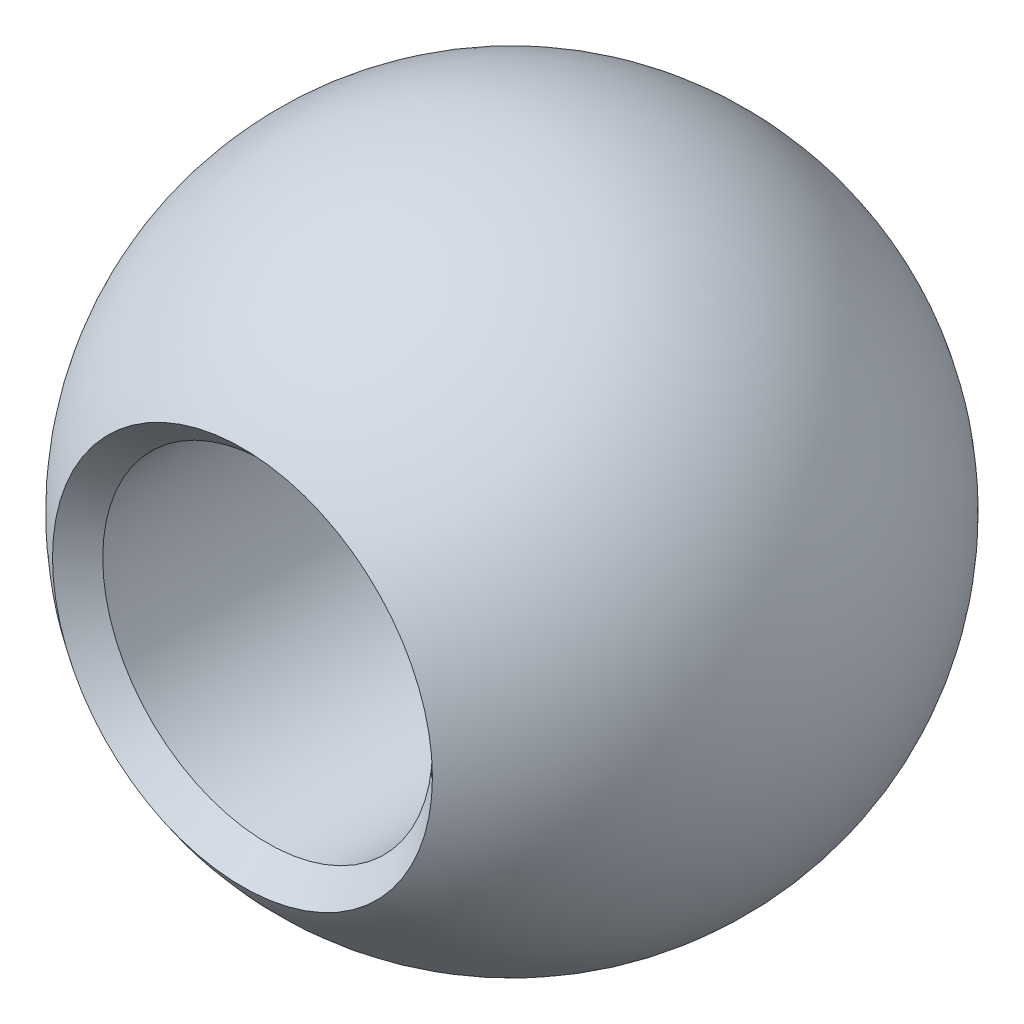
ISO-10303-21;
HEADER;
FILE_DESCRIPTION(('STEP AP214'),'2;1');
FILE_NAME('part.step','',(''),(''),'','','');
FILE_SCHEMA(('AUTOMOTIVE_DESIGN { 1 0 10303 214 1 1 1 1 }'));
ENDSEC;
DATA;
#1=APPLICATION_CONTEXT('core data for automotive mechanical design processes');
#2=APPLICATION_PROTOCOL_DEFINITION('international standard','automotive_design',2000,#1);
#3=PRODUCT_CONTEXT('',#1,'mechanical');
#4=PRODUCT('Part','Part','',(#3));
#5=PRODUCT_RELATED_PRODUCT_CATEGORY('part','',(#4));
#6=PRODUCT_DEFINITION_FORMATION('','',#4);
#7=PRODUCT_DEFINITION_CONTEXT('part definition',#1,'design');
#8=PRODUCT_DEFINITION('design','',#6,#7);
#9=PRODUCT_DEFINITION_SHAPE('','',#8);
#10=(LENGTH_UNIT() NAMED_UNIT(*) SI_UNIT(.MILLI.,.METRE.));
#11=(NAMED_UNIT(*) PLANE_ANGLE_UNIT() SI_UNIT($,.RADIAN.));
#12=(NAMED_UNIT(*) SI_UNIT($,.STERADIAN.) SOLID_ANGLE_UNIT());
#13=UNCERTAINTY_MEASURE_WITH_UNIT(LENGTH_MEASURE(1.E-05),#10,'distance_accuracy_value','');
#14=(GEOMETRIC_REPRESENTATION_CONTEXT(3) GLOBAL_UNCERTAINTY_ASSIGNED_CONTEXT((#13)) GLOBAL_UNIT_ASSIGNED_CONTEXT((#10,
#11,#12)) REPRESENTATION_CONTEXT('',''));
#15=CARTESIAN_POINT('',(0.,0.,0.));
#16=DIRECTION('',(0.,0.,1.));
#17=DIRECTION('',(1.,0.,0.));
#18=AXIS2_PLACEMENT_3D('',#15,#16,#17);
#19=CARTESIAN_POINT('',(0.,0.,0.));
#20=DIRECTION('',(0.,1.,0.));
#21=DIRECTION('',(1.,0.,0.));
#22=AXIS2_PLACEMENT_3D('',#19,#20,#21);
#23=SPHERICAL_SURFACE('',#22,8.);
#24=CARTESIAN_POINT('',(0.,0.,0.));
#25=DIRECTION('',(0.,0.,1.));
#26=DIRECTION('',(1.,0.,0.));
#27=AXIS2_PLACEMENT_3D('',#24,#25,#26);
#28=SPHERICAL_SURFACE('',#27,8.);
#29=CARTESIAN_POINT('',(0.,0.,-6.53819419381716));
#30=DIRECTION('',(0.,0.,1.));
#31=DIRECTION('',(1.,0.,0.));
#32=AXIS2_PLACEMENT_3D('',#29,#30,#31);
#33=CIRCLE('',#32,4.60999096354164);
#34=CARTESIAN_POINT('',(4.60999096354164,0.,-6.53819419381716));
#35=VERTEX_POINT('',#34);
#36=EDGE_CURVE('E45',#35,#35,#33,.T.);
#37=ORIENTED_EDGE('',*,*,#36,.T.);
#38=EDGE_LOOP('',(#37));
#39=FACE_BOUND('',#38,.T.);
#40=CARTESIAN_POINT('',(0.,0.,6.53819419381716));
#41=DIRECTION('',(0.,0.,-1.));
#42=DIRECTION('',(-1.,0.,0.));
#43=AXIS2_PLACEMENT_3D('',#40,#41,#42);
#44=CIRCLE('',#43,4.60999096354165);
#45=CARTESIAN_POINT('',(-4.60999096354165,0.,6.53819419381716));
#46=VERTEX_POINT('',#45);
#47=EDGE_CURVE('E49',#46,#46,#44,.T.);
#48=ORIENTED_EDGE('',*,*,#47,.T.);
#49=EDGE_LOOP('',(#48));
#50=FACE_BOUND('',#49,.T.);
#51=ADVANCED_FACE('F34',(#39,#50),#28,.T.);
#52=CARTESIAN_POINT('',(0.,0.,-8.));
#53=DIRECTION('',(0.,0.,1.));
#54=DIRECTION('',(1.,0.,0.));
#55=AXIS2_PLACEMENT_3D('',#52,#53,#54);
#56=CYLINDRICAL_SURFACE('',#55,4.);
#57=CARTESIAN_POINT('',(0.,0.,-5.92820323027552));
#58=DIRECTION('',(0.,0.,1.));
#59=DIRECTION('',(1.,0.,0.));
#60=AXIS2_PLACEMENT_3D('',#57,#58,#59);
#61=CIRCLE('',#60,4.);
#62=CARTESIAN_POINT('',(4.,0.,-5.92820323027552));
#63=VERTEX_POINT('',#62);
#64=EDGE_CURVE('E10',#63,#63,#61,.F.);
#65=ORIENTED_EDGE('',*,*,#64,.T.);
#66=EDGE_LOOP('',(#65));
#67=FACE_BOUND('',#66,.T.);
#68=CARTESIAN_POINT('',(0.,0.,5.92820323027551));
#69=DIRECTION('',(0.,0.,-1.));
#70=DIRECTION('',(-1.,0.,0.));
#71=AXIS2_PLACEMENT_3D('',#68,#69,#70);
#72=CIRCLE('',#71,4.);
#73=CARTESIAN_POINT('',(-4.,0.,5.92820323027551));
#74=VERTEX_POINT('',#73);
#75=EDGE_CURVE('E41',#74,#74,#72,.F.);
#76=ORIENTED_EDGE('',*,*,#75,.T.);
#77=EDGE_LOOP('',(#76));
#78=FACE_BOUND('',#77,.T.);
#79=ADVANCED_FACE('F62',(#67,#78),#56,.F.);
#80=CARTESIAN_POINT('',(0.,0.,-6.53819419381716));
#81=DIRECTION('',(0.,0.,-1.));
#82=DIRECTION('',(-1.,0.,0.));
#83=AXIS2_PLACEMENT_3D('',#80,#81,#82);
#84=CONICAL_SURFACE('',#83,4.60999096354164,0.785398163397443);
#85=ORIENTED_EDGE('',*,*,#64,.F.);
#86=EDGE_LOOP('',(#85));
#87=FACE_BOUND('',#86,.T.);
#88=ORIENTED_EDGE('',*,*,#36,.F.);
#89=EDGE_LOOP('',(#88));
#90=FACE_BOUND('',#89,.T.);
#91=ADVANCED_FACE('F57',(#87,#90),#84,.F.);
#92=CARTESIAN_POINT('',(0.,0.,6.53819419381715));
#93=DIRECTION('',(0.,0.,1.));
#94=DIRECTION('',(1.,0.,0.));
#95=AXIS2_PLACEMENT_3D('',#92,#93,#94);
#96=CONICAL_SURFACE('',#95,4.60999096354165,0.785398163397448);
#97=ORIENTED_EDGE('',*,*,#75,.F.);
#98=EDGE_LOOP('',(#97));
#99=FACE_BOUND('',#98,.T.);
#100=ORIENTED_EDGE('',*,*,#47,.F.);
#101=EDGE_LOOP('',(#100));
#102=FACE_BOUND('',#101,.T.);
#103=ADVANCED_FACE('F36',(#99,#102),#96,.F.);
#104=CLOSED_SHELL('',(#51,#79,#91,#103));
#105=MANIFOLD_SOLID_BREP('B2',#104);
#106=ADVANCED_BREP_SHAPE_REPRESENTATION('',(#18,#105),#14);
#107=SHAPE_DEFINITION_REPRESENTATION(#9,#106);
ENDSEC;
END-ISO-10303-21;
